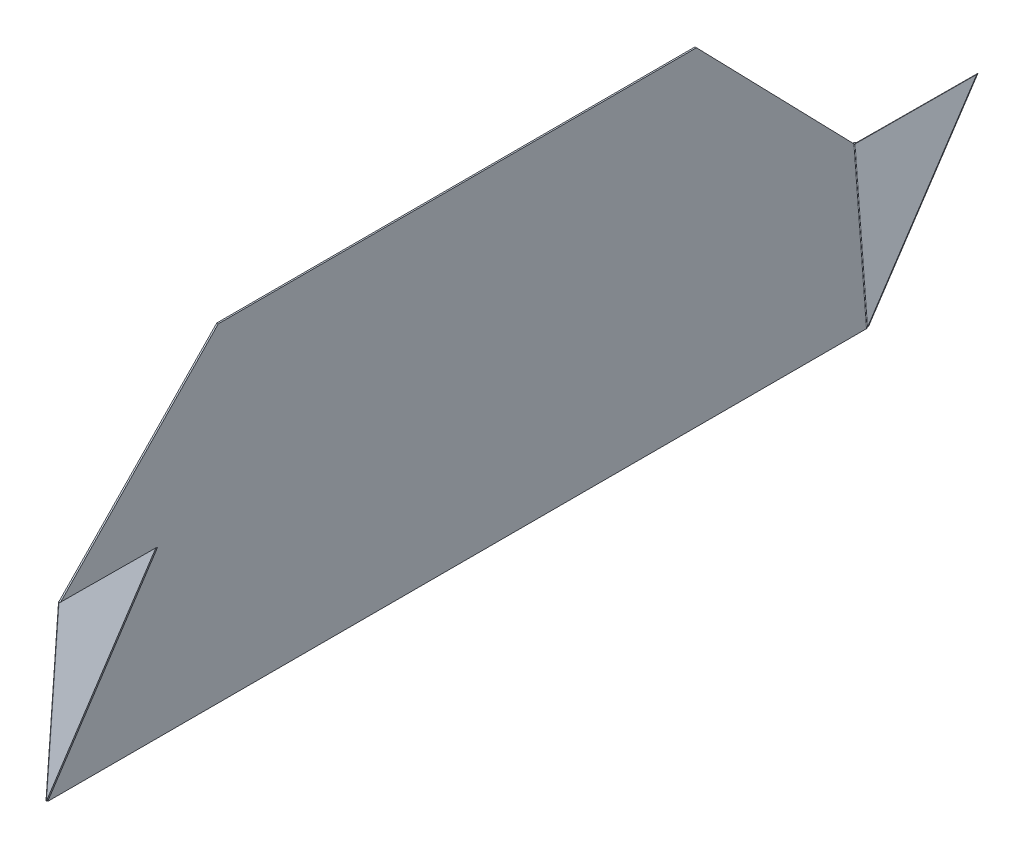
ISO-10303-21;
HEADER;
FILE_DESCRIPTION(('STEP AP214'),'2;1');
FILE_NAME('part.step','',(''),(''),'','','');
FILE_SCHEMA(('AUTOMOTIVE_DESIGN { 1 0 10303 214 1 1 1 1 }'));
ENDSEC;
DATA;
#1=APPLICATION_CONTEXT('core data for automotive mechanical design processes');
#2=APPLICATION_PROTOCOL_DEFINITION('international standard','automotive_design',2000,#1);
#3=PRODUCT_CONTEXT('',#1,'mechanical');
#4=PRODUCT('Part','Part','',(#3));
#5=PRODUCT_RELATED_PRODUCT_CATEGORY('part','',(#4));
#6=PRODUCT_DEFINITION_FORMATION('','',#4);
#7=PRODUCT_DEFINITION_CONTEXT('part definition',#1,'design');
#8=PRODUCT_DEFINITION('design','',#6,#7);
#9=PRODUCT_DEFINITION_SHAPE('','',#8);
#10=(LENGTH_UNIT() NAMED_UNIT(*) SI_UNIT(.MILLI.,.METRE.));
#11=(NAMED_UNIT(*) PLANE_ANGLE_UNIT() SI_UNIT($,.RADIAN.));
#12=(NAMED_UNIT(*) SI_UNIT($,.STERADIAN.) SOLID_ANGLE_UNIT());
#13=UNCERTAINTY_MEASURE_WITH_UNIT(LENGTH_MEASURE(1.E-05),#10,'distance_accuracy_value','');
#14=(GEOMETRIC_REPRESENTATION_CONTEXT(3) GLOBAL_UNCERTAINTY_ASSIGNED_CONTEXT((#13)) GLOBAL_UNIT_ASSIGNED_CONTEXT((#10,
#11,#12)) REPRESENTATION_CONTEXT('',''));
#15=CARTESIAN_POINT('',(0.,0.,0.));
#16=DIRECTION('',(0.,0.,1.));
#17=DIRECTION('',(1.,0.,0.));
#18=AXIS2_PLACEMENT_3D('',#15,#16,#17);
#19=CARTESIAN_POINT('',(10.,0.,0.));
#20=DIRECTION('',(0.,1.,0.));
#21=DIRECTION('',(0.,0.,1.));
#22=AXIS2_PLACEMENT_3D('',#19,#20,#21);
#23=PLANE('',#22);
#24=DIRECTION('',(1.,0.,0.));
#25=VECTOR('',#24,1.);
#26=CARTESIAN_POINT('',(10.,0.,419.37639410595));
#27=LINE('',#26,#25);
#28=CARTESIAN_POINT('',(8.49999999999995,0.,419.37639410595));
#29=VERTEX_POINT('',#28);
#30=CARTESIAN_POINT('',(10.,0.,419.37639410595));
#31=VERTEX_POINT('',#30);
#32=EDGE_CURVE('E11',#29,#31,#27,.T.);
#33=ORIENTED_EDGE('',*,*,#32,.F.);
#34=DIRECTION('',(0.,0.,-1.));
#35=VECTOR('',#34,1.);
#36=CARTESIAN_POINT('',(8.49999999999995,0.,0.));
#37=LINE('',#36,#35);
#38=CARTESIAN_POINT('',(8.49999999999995,0.,-419.37639410595));
#39=VERTEX_POINT('',#38);
#40=EDGE_CURVE('E86',#39,#29,#37,.F.);
#41=ORIENTED_EDGE('',*,*,#40,.F.);
#42=DIRECTION('',(1.,0.,0.));
#43=VECTOR('',#42,1.);
#44=CARTESIAN_POINT('',(10.,0.,-419.37639410595));
#45=LINE('',#44,#43);
#46=CARTESIAN_POINT('',(10.,0.,-419.37639410595));
#47=VERTEX_POINT('',#46);
#48=EDGE_CURVE('E119',#39,#47,#45,.T.);
#49=ORIENTED_EDGE('',*,*,#48,.T.);
#50=DIRECTION('',(0.,0.,1.));
#51=VECTOR('',#50,1.);
#52=CARTESIAN_POINT('',(10.,0.,0.));
#53=LINE('',#52,#51);
#54=EDGE_CURVE('E89',#47,#31,#53,.T.);
#55=ORIENTED_EDGE('',*,*,#54,.T.);
#56=EDGE_LOOP('',(#33,#41,#49,#55));
#57=FACE_BOUND('',#56,.T.);
#58=ADVANCED_FACE('F39',(#57),#23,.F.);
#59=CARTESIAN_POINT('',(10.,336.667890503002,0.));
#60=DIRECTION('',(0.,1.,0.));
#61=DIRECTION('',(0.,0.,1.));
#62=AXIS2_PLACEMENT_3D('',#59,#60,#61);
#63=PLANE('',#62);
#64=DIRECTION('',(0.,0.,1.));
#65=VECTOR('',#64,1.);
#66=CARTESIAN_POINT('',(10.,336.667890503002,0.));
#67=LINE('',#66,#65);
#68=CARTESIAN_POINT('',(10.,336.667890503002,-245.16369055211));
#69=VERTEX_POINT('',#68);
#70=CARTESIAN_POINT('',(10.,336.667890503002,245.16369055211));
#71=VERTEX_POINT('',#70);
#72=EDGE_CURVE('E144',#69,#71,#67,.T.);
#73=ORIENTED_EDGE('',*,*,#72,.F.);
#74=DIRECTION('',(1.,0.,0.));
#75=VECTOR('',#74,1.);
#76=CARTESIAN_POINT('',(10.,336.667890503002,-245.16369055211));
#77=LINE('',#76,#75);
#78=CARTESIAN_POINT('',(8.49999999999995,336.667890503002,-245.16369055211));
#79=VERTEX_POINT('',#78);
#80=EDGE_CURVE('E123',#79,#69,#77,.T.);
#81=ORIENTED_EDGE('',*,*,#80,.F.);
#82=DIRECTION('',(0.,0.,-1.));
#83=VECTOR('',#82,1.);
#84=CARTESIAN_POINT('',(8.49999999999995,336.667890503002,0.));
#85=LINE('',#84,#83);
#86=CARTESIAN_POINT('',(8.49999999999995,336.667890503002,245.16369055211));
#87=VERTEX_POINT('',#86);
#88=EDGE_CURVE('E121',#79,#87,#85,.F.);
#89=ORIENTED_EDGE('',*,*,#88,.T.);
#90=DIRECTION('',(1.,0.,0.));
#91=VECTOR('',#90,1.);
#92=CARTESIAN_POINT('',(10.,336.667890503002,245.16369055211));
#93=LINE('',#92,#91);
#94=EDGE_CURVE('E51',#87,#71,#93,.T.);
#95=ORIENTED_EDGE('',*,*,#94,.T.);
#96=EDGE_LOOP('',(#73,#81,#89,#95));
#97=FACE_BOUND('',#96,.T.);
#98=ADVANCED_FACE('F141',(#97),#63,.T.);
#99=CARTESIAN_POINT('',(10.,170.,407.16369055211));
#100=DIRECTION('',(0.,0.696993838192432,0.717077115463729));
#101=DIRECTION('',(0.,-0.717077115463729,0.696993838192432));
#102=AXIS2_PLACEMENT_3D('',#99,#100,#101);
#103=PLANE('',#102);
#104=ORIENTED_EDGE('',*,*,#94,.F.);
#105=DIRECTION('',(0.,-0.717077115463729,0.696993838192432));
#106=VECTOR('',#105,1.);
#107=CARTESIAN_POINT('',(8.49999999999995,170.,407.16369055211));
#108=LINE('',#107,#106);
#109=CARTESIAN_POINT('',(8.49999999999995,170.695612065733,406.487560589052));
#110=VERTEX_POINT('',#109);
#111=EDGE_CURVE('E116',#87,#110,#108,.T.);
#112=ORIENTED_EDGE('',*,*,#111,.T.);
#113=DIRECTION('',(1.,0.,0.));
#114=VECTOR('',#113,1.);
#115=CARTESIAN_POINT('',(10.,170.695612065733,406.487560589052));
#116=LINE('',#115,#114);
#117=CARTESIAN_POINT('',(10.,170.695612065733,406.487560589052));
#118=VERTEX_POINT('',#117);
#119=EDGE_CURVE('E132',#110,#118,#116,.T.);
#120=ORIENTED_EDGE('',*,*,#119,.T.);
#121=DIRECTION('',(0.,-0.717077115463729,0.696993838192432));
#122=VECTOR('',#121,1.);
#123=CARTESIAN_POINT('',(10.,170.,407.16369055211));
#124=LINE('',#123,#122);
#125=EDGE_CURVE('E155',#71,#118,#124,.T.);
#126=ORIENTED_EDGE('',*,*,#125,.F.);
#127=EDGE_LOOP('',(#104,#112,#120,#126));
#128=FACE_BOUND('',#127,.T.);
#129=ADVANCED_FACE('F163',(#128),#103,.T.);
#130=CARTESIAN_POINT('',(10.2173044583433,170.366797823547,407.041845531977));
#131=CARTESIAN_POINT('',(9.86217409723888,170.393298781834,407.392815795434));
#132=CARTESIAN_POINT('',(9.50704373613442,170.419799740121,407.743786058892));
#133=CARTESIAN_POINT('',(9.15191337502996,170.446300698408,408.09475632235));
#134=CARTESIAN_POINT('',(11.273212522332,170.447014706875,408.104212423419));
#135=CARTESIAN_POINT('',(11.6220208705534,170.526993587381,409.163427281172));
#136=CARTESIAN_POINT('',(11.9708292187745,170.606972467886,410.222642138925));
#137=CARTESIAN_POINT('',(12.3196375669958,170.686951348391,411.281856996677));
#138=CARTESIAN_POINT('',(12.3386036056454,172.911631375804,406.859201011066));
#139=CARTESIAN_POINT('',(13.3976726760756,172.938608339735,407.216475341903));
#140=CARTESIAN_POINT('',(14.4567417465058,172.965585303667,407.57374967274));
#141=CARTESIAN_POINT('',(15.515810816936,172.992562267599,407.931024003577));
#142=CARTESIAN_POINT('',(11.2826955416567,172.831414492476,405.796834119624));
#143=CARTESIAN_POINT('',(11.6378259027612,172.804913534189,405.445863856166));
#144=CARTESIAN_POINT('',(11.9929562638657,172.778412575902,405.094893592708));
#145=CARTESIAN_POINT('',(12.3480866249701,172.751911617615,404.74392332925));
#146=CARTESIAN_POINT('',(10.2267874776679,172.751197609148,404.734467228181));
#147=CARTESIAN_POINT('',(9.87797912944655,172.671218728642,403.675252370428));
#148=CARTESIAN_POINT('',(9.5291707812255,172.591239848137,402.616037512676));
#149=CARTESIAN_POINT('',(9.18036243300413,172.511260967632,401.556822654923));
#150=CARTESIAN_POINT('',(9.16139639435454,170.286580940219,405.979478640534));
#151=CARTESIAN_POINT('',(8.10232732392435,170.259603976288,405.622204309697));
#152=CARTESIAN_POINT('',(7.04325825349417,170.232627012356,405.26492997886));
#153=CARTESIAN_POINT('',(5.98418918306398,170.205650048424,404.907655648023));
#154=CARTESIAN_POINT('',(10.2173044583433,170.366797823547,407.041845531977));
#155=CARTESIAN_POINT('',(9.86217409723888,170.393298781834,407.392815795434));
#156=CARTESIAN_POINT('',(9.50704373613442,170.419799740121,407.743786058892));
#157=CARTESIAN_POINT('',(9.15191337502996,170.446300698408,408.09475632235));
#158=(BOUNDED_SURFACE() B_SPLINE_SURFACE(3,3,((#130,#131,#132,#133),(#134,#135,#136,#137),(#138,
#139,#140,#141),(#142,#143,#144,#145),(#146,#147,#148,#149),(#150,#151,#152,#153),(#154,#155,
#156,#157)),.UNSPECIFIED.,.T.,.F.,.F.) B_SPLINE_SURFACE_WITH_KNOTS((4,3,4),(4,4),(0.,0.5,1.),
(0.,1.),.UNSPECIFIED.) GEOMETRIC_REPRESENTATION_ITEM() RATIONAL_B_SPLINE_SURFACE(((1.,1.,1.,1.),
(0.333333333333333,0.333333333333333,0.333333333333333,0.333333333333333),(0.333333333333333,
0.333333333333333,0.333333333333333,0.333333333333333),(1.,1.,1.,1.),(0.333333333333333,
0.333333333333333,0.333333333333333,0.333333333333333),(0.333333333333333,0.333333333333333,
0.333333333333333,0.333333333333333),(1.,1.,1.,1.))) REPRESENTATION_ITEM('') SURFACE());
#159=CARTESIAN_POINT('',(10.75,171.599106158011,406.4193398258));
#160=DIRECTION('',(-0.350308985086468,0.893581116930475,0.28070696897828));
#161=DIRECTION('',(-0.617862370176753,-0.445704946461743,0.647760134786867));
#162=AXIS2_PLACEMENT_3D('',#159,#160,#161);
#163=ELLIPSE('',#162,2.58647670113481,2.25);
#164=CARTESIAN_POINT('',(10.333223597649,170.718270894438,408.703206316444));
#165=VERTEX_POINT('',#164);
#166=EDGE_CURVE('E103',#110,#165,#163,.T.);
#167=DIRECTION('',(0.185233956600411,-0.07399037522197,-0.979904998301707));
#168=VECTOR('',#167,1.);
#169=CARTESIAN_POINT('',(10.6110745325496,170.607285331605,407.233348818991));
#170=LINE('',#169,#168);
#171=CARTESIAN_POINT('',(10.6110745325496,170.607285331605,407.233348818991));
#172=VERTEX_POINT('',#171);
#173=EDGE_CURVE('E130',#165,#172,#170,.T.);
#174=CARTESIAN_POINT('',(10.75,171.599106158011,406.4193398258));
#175=DIRECTION('',(-0.612282012254421,0.551070823812249,0.566949455077405));
#176=DIRECTION('',(-0.359973653178135,-0.832743093023334,0.420663654288695));
#177=AXIS2_PLACEMENT_3D('',#174,#175,#176);
#178=ELLIPSE('',#177,1.47981813933777,0.75);
#179=EDGE_CURVE('E161',#118,#172,#178,.T.);
#180=ORIENTED_EDGE('',*,*,#119,.F.);
#181=ORIENTED_EDGE('',*,*,#166,.T.);
#182=ORIENTED_EDGE('',*,*,#173,.T.);
#183=ORIENTED_EDGE('',*,*,#179,.F.);
#184=EDGE_LOOP('',(#180,#181,#182,#183));
#185=FACE_BOUND('',#184,.T.);
#186=ADVANCED_FACE('F294',(#185),#158,.F.);
#187=CARTESIAN_POINT('',(66.3030214988494,225.953893117886,413.581845276055));
#188=DIRECTION('',(-0.682529199996483,0.707716651063141,-0.182458304716812));
#189=DIRECTION('',(-0.706995242186479,-0.702611248260718,-0.0805925638207273));
#190=AXIS2_PLACEMENT_3D('',#187,#188,#189);
#191=PLANE('',#190);
#192=ORIENTED_EDGE('',*,*,#173,.F.);
#193=DIRECTION('',(-0.706995242186479,-0.702611248260718,-0.0805925638207273));
#194=VECTOR('',#193,1.);
#195=CARTESIAN_POINT('',(66.025170563949,226.064878680719,415.051702773508));
#196=LINE('',#195,#194);
#197=CARTESIAN_POINT('',(122.328192062798,282.018771798606,421.469857497453));
#198=VERTEX_POINT('',#197);
#199=EDGE_CURVE('E115',#198,#165,#196,.T.);
#200=ORIENTED_EDGE('',*,*,#199,.F.);
#201=DIRECTION('',(0.185233956600411,-0.07399037522197,-0.979904998301707));
#202=VECTOR('',#201,1.);
#203=CARTESIAN_POINT('',(122.606042997699,281.907786235773,420.));
#204=LINE('',#203,#202);
#205=CARTESIAN_POINT('',(122.606042997699,281.907786235773,420.));
#206=VERTEX_POINT('',#205);
#207=EDGE_CURVE('E127',#198,#206,#204,.T.);
#208=ORIENTED_EDGE('',*,*,#207,.T.);
#209=DIRECTION('',(-0.706995242186479,-0.702611248260718,-0.0805925638207273));
#210=VECTOR('',#209,1.);
#211=CARTESIAN_POINT('',(66.3030214988494,225.953893117886,413.581845276055));
#212=LINE('',#211,#210);
#213=EDGE_CURVE('E165',#206,#172,#212,.T.);
#214=ORIENTED_EDGE('',*,*,#213,.T.);
#215=EDGE_LOOP('',(#192,#200,#208,#214));
#216=FACE_BOUND('',#215,.T.);
#217=ADVANCED_FACE('F282',(#216),#191,.T.);
#218=CARTESIAN_POINT('',(66.3030214988494,140.953893117886,420.));
#219=DIRECTION('',(0.909993681143599,-0.363490448258812,0.19946476957932));
#220=DIRECTION('',(0.370944580228475,0.928655005047149,0.));
#221=AXIS2_PLACEMENT_3D('',#218,#219,#220);
#222=PLANE('',#221);
#223=ORIENTED_EDGE('',*,*,#207,.F.);
#224=DIRECTION('',(0.370944580228475,0.928655005047149,0.));
#225=VECTOR('',#224,1.);
#226=CARTESIAN_POINT('',(66.0251705639487,141.064878680719,421.469857497453));
#227=LINE('',#226,#225);
#228=CARTESIAN_POINT('',(10.333223597649,1.64080282761021,421.469857497453));
#229=VERTEX_POINT('',#228);
#230=EDGE_CURVE('E108',#229,#198,#227,.T.);
#231=ORIENTED_EDGE('',*,*,#230,.F.);
#232=DIRECTION('',(0.185233956600395,-0.0739903752219733,-0.97990499830171));
#233=VECTOR('',#232,1.);
#234=CARTESIAN_POINT('',(10.6110745325496,1.52981726477719,420.));
#235=LINE('',#234,#233);
#236=CARTESIAN_POINT('',(10.6110745325496,1.52981726477719,420.));
#237=VERTEX_POINT('',#236);
#238=EDGE_CURVE('E45',#229,#237,#235,.T.);
#239=ORIENTED_EDGE('',*,*,#238,.T.);
#240=DIRECTION('',(0.370944580228475,0.928655005047149,0.));
#241=VECTOR('',#240,1.);
#242=CARTESIAN_POINT('',(66.3030214988494,140.953893117886,420.));
#243=LINE('',#242,#241);
#244=EDGE_CURVE('E171',#237,#206,#243,.T.);
#245=ORIENTED_EDGE('',*,*,#244,.T.);
#246=EDGE_LOOP('',(#223,#231,#239,#245));
#247=FACE_BOUND('',#246,.T.);
#248=ADVANCED_FACE('F287',(#247),#222,.T.);
#249=CARTESIAN_POINT('',(8.50101690580463,0.00424378517362156,419.443905269473));
#250=CARTESIAN_POINT('',(9.00079092673711,0.00311205796636738,419.428917034263));
#251=CARTESIAN_POINT('',(9.50056494766938,0.00198033075912707,419.413928799053));
#252=CARTESIAN_POINT('',(10.0003389686016,0.000848603551872884,419.398940563843));
#253=CARTESIAN_POINT('',(8.36573879192248,-0.334423240107767,414.958706892824));
#254=CARTESIAN_POINT('',(8.89557461593948,-0.260295628363598,415.940429407981));
#255=CARTESIAN_POINT('',(9.42541043995682,-0.186168016619429,416.922151923137));
#256=CARTESIAN_POINT('',(9.95524626397415,-0.112040404875259,417.903874438293));
#257=CARTESIAN_POINT('',(12.8637049803129,3.4123199755362,414.540135716267));
#258=CARTESIAN_POINT('',(12.3939927624656,3.48871104169488,415.551834701843));
#259=CARTESIAN_POINT('',(11.9242805446182,3.56510210785355,416.563533687419));
#260=CARTESIAN_POINT('',(11.4545683267709,3.64149317401223,417.575232672995));
#261=CARTESIAN_POINT('',(12.9989830941952,3.75098700081759,419.025334092915));
#262=CARTESIAN_POINT('',(12.499209073263,3.75211872802485,419.040322328125));
#263=CARTESIAN_POINT('',(11.9994350523307,3.7532504552321,419.055310563335));
#264=CARTESIAN_POINT('',(11.4996610313984,3.75438218243936,419.070298798545));
#265=CARTESIAN_POINT('',(13.1342612080778,4.089654026099,423.510532469564));
#266=CARTESIAN_POINT('',(12.6044253840605,4.01552641435483,422.528809954408));
#267=CARTESIAN_POINT('',(12.0745895600431,3.94139880261066,421.547087439251));
#268=CARTESIAN_POINT('',(11.5447537360258,3.86727119086649,420.565364924095));
#269=CARTESIAN_POINT('',(8.6362950196871,0.342910810455024,423.929103646121));
#270=CARTESIAN_POINT('',(9.10600723753441,0.266519744296343,422.917404660545));
#271=CARTESIAN_POINT('',(9.57571945538172,0.190128678137672,421.905705674969));
#272=CARTESIAN_POINT('',(10.045431673229,0.113737611979001,420.894006689392));
#273=CARTESIAN_POINT('',(8.50101690580463,0.00424378517362156,419.443905269473));
#274=CARTESIAN_POINT('',(9.00079092673711,0.00311205796636738,419.428917034263));
#275=CARTESIAN_POINT('',(9.50056494766938,0.00198033075912707,419.413928799053));
#276=CARTESIAN_POINT('',(10.0003389686016,0.000848603551872884,419.398940563843));
#277=(BOUNDED_SURFACE() B_SPLINE_SURFACE(3,3,((#249,#250,#251,#252),(#253,#254,#255,#256),(#257,
#258,#259,#260),(#261,#262,#263,#264),(#265,#266,#267,#268),(#269,#270,#271,#272),(#273,#274,
#275,#276)),.UNSPECIFIED.,.T.,.F.,.F.) B_SPLINE_SURFACE_WITH_KNOTS((4,3,4),(4,4),(0.,0.5,1.),
(0.,1.),.UNSPECIFIED.) GEOMETRIC_REPRESENTATION_ITEM() RATIONAL_B_SPLINE_SURFACE(((1.,1.,1.,1.),
(0.333333333333333,0.333333333333333,0.333333333333333,0.333333333333333),(0.333333333333333,
0.333333333333333,0.333333333333333,0.333333333333333),(1.,1.,1.,1.),(0.333333333333333,
0.333333333333333,0.333333333333333,0.333333333333333),(0.333333333333333,0.333333333333333,
0.333333333333333,0.333333333333333),(1.,1.,1.,1.))) REPRESENTATION_ITEM('') SURFACE());
#278=CARTESIAN_POINT('',(10.75,1.87761539299561,419.234619681194));
#279=DIRECTION('',(-0.641664709039219,0.766019024423177,-0.0384870808892977));
#280=DIRECTION('',(-0.766395908893631,-0.638397122583083,0.0713191749023056));
#281=AXIS2_PLACEMENT_3D('',#278,#279,#280);
#282=ELLIPSE('',#281,2.93449256199957,2.25);
#283=EDGE_CURVE('E101',#229,#29,#282,.F.);
#284=CARTESIAN_POINT('',(10.75,1.87761539299561,419.234619681194));
#285=DIRECTION('',(-0.928655005047149,0.370944580228475,0.));
#286=DIRECTION('',(-0.369724450903859,-0.925600426912021,0.081041224720044));
#287=AXIS2_PLACEMENT_3D('',#284,#285,#286);
#288=ELLIPSE('',#287,2.02762092029818,0.75);
#289=EDGE_CURVE('E178',#237,#31,#288,.F.);
#290=ORIENTED_EDGE('',*,*,#283,.T.);
#291=ORIENTED_EDGE('',*,*,#32,.T.);
#292=ORIENTED_EDGE('',*,*,#289,.F.);
#293=ORIENTED_EDGE('',*,*,#238,.F.);
#294=EDGE_LOOP('',(#290,#291,#292,#293));
#295=FACE_BOUND('',#294,.T.);
#296=ADVANCED_FACE('F41',(#295),#277,.T.);
#297=CARTESIAN_POINT('',(10.,170.,407.16369055211));
#298=DIRECTION('',(-0.185233956600411,0.07399037522197,0.979904998301707));
#299=DIRECTION('',(0.,-0.997161425585,0.0752933684018133));
#300=AXIS2_PLACEMENT_3D('',#297,#298,#299);
#301=PLANE('',#300);
#302=ORIENTED_EDGE('',*,*,#244,.F.);
#303=DIRECTION('',(0.,-0.997161425585,0.0752933684018133));
#304=VECTOR('',#303,1.);
#305=CARTESIAN_POINT('',(10.6110745325496,170.008672673785,407.278548685551));
#306=LINE('',#305,#304);
#307=EDGE_CURVE('E175',#237,#172,#306,.F.);
#308=ORIENTED_EDGE('',*,*,#307,.T.);
#309=ORIENTED_EDGE('',*,*,#213,.F.);
#310=EDGE_LOOP('',(#302,#308,#309));
#311=FACE_BOUND('',#310,.T.);
#312=ADVANCED_FACE('F285',(#311),#301,.F.);
#313=CARTESIAN_POINT('',(10.,0.,0.));
#314=DIRECTION('',(1.,0.,0.));
#315=DIRECTION('',(0.,0.,-1.));
#316=AXIS2_PLACEMENT_3D('',#313,#314,#315);
#317=PLANE('',#316);
#318=ORIENTED_EDGE('',*,*,#125,.T.);
#319=DIRECTION('',(0.,-0.997161425585,0.0752933684018133));
#320=VECTOR('',#319,1.);
#321=CARTESIAN_POINT('',(10.,31.486629772881,416.998911028092));
#322=LINE('',#321,#320);
#323=EDGE_CURVE('E173',#118,#31,#322,.T.);
#324=ORIENTED_EDGE('',*,*,#323,.T.);
#325=ORIENTED_EDGE('',*,*,#54,.F.);
#326=DIRECTION('',(0.,-0.997161425585,-0.0752933684018133));
#327=VECTOR('',#326,1.);
#328=CARTESIAN_POINT('',(10.,31.486629772881,-416.998911028092));
#329=LINE('',#328,#327);
#330=CARTESIAN_POINT('',(10.,170.695612065733,-406.487560589052));
#331=VERTEX_POINT('',#330);
#332=EDGE_CURVE('E217',#331,#47,#329,.T.);
#333=ORIENTED_EDGE('',*,*,#332,.F.);
#334=DIRECTION('',(0.,-0.717077115463729,-0.696993838192432));
#335=VECTOR('',#334,1.);
#336=CARTESIAN_POINT('',(10.,170.,-407.16369055211));
#337=LINE('',#336,#335);
#338=EDGE_CURVE('E159',#69,#331,#337,.T.);
#339=ORIENTED_EDGE('',*,*,#338,.F.);
#340=ORIENTED_EDGE('',*,*,#72,.T.);
#341=EDGE_LOOP('',(#318,#324,#325,#333,#339,#340));
#342=FACE_BOUND('',#341,.T.);
#343=ADVANCED_FACE('F153',(#342),#317,.T.);
#344=CARTESIAN_POINT('',(10.75,31.486629772881,416.998911028092));
#345=DIRECTION('',(0.,-0.997161425585,0.0752933684018133));
#346=DIRECTION('',(0.,-0.0752933684018133,-0.997161425585));
#347=AXIS2_PLACEMENT_3D('',#344,#345,#346);
#348=CYLINDRICAL_SURFACE('',#347,0.75);
#349=ORIENTED_EDGE('',*,*,#179,.T.);
#350=ORIENTED_EDGE('',*,*,#307,.F.);
#351=ORIENTED_EDGE('',*,*,#289,.T.);
#352=ORIENTED_EDGE('',*,*,#323,.F.);
#353=EDGE_LOOP('',(#349,#350,#351,#352));
#354=FACE_BOUND('',#353,.T.);
#355=ADVANCED_FACE('F318',(#354),#348,.F.);
#356=CARTESIAN_POINT('',(9.72214906509938,170.110985562832,408.633548049563));
#357=DIRECTION('',(-0.185233956600411,0.07399037522197,0.979904998301707));
#358=DIRECTION('',(0.,-0.997161425585,0.0752933684018133));
#359=AXIS2_PLACEMENT_3D('',#356,#357,#358);
#360=PLANE('',#359);
#361=ORIENTED_EDGE('',*,*,#230,.T.);
#362=ORIENTED_EDGE('',*,*,#199,.T.);
#363=DIRECTION('',(0.,-0.997161425585,0.0752933684018133));
#364=VECTOR('',#363,1.);
#365=CARTESIAN_POINT('',(10.333223597649,170.119658236618,408.748406183004));
#366=LINE('',#365,#364);
#367=EDGE_CURVE('E107',#229,#165,#366,.F.);
#368=ORIENTED_EDGE('',*,*,#367,.F.);
#369=EDGE_LOOP('',(#361,#362,#368));
#370=FACE_BOUND('',#369,.T.);
#371=ADVANCED_FACE('F320',(#370),#360,.T.);
#372=CARTESIAN_POINT('',(8.49999999999995,0.,0.));
#373=DIRECTION('',(1.,0.,0.));
#374=DIRECTION('',(0.,0.,-1.));
#375=AXIS2_PLACEMENT_3D('',#372,#373,#374);
#376=PLANE('',#375);
#377=ORIENTED_EDGE('',*,*,#111,.F.);
#378=ORIENTED_EDGE('',*,*,#88,.F.);
#379=DIRECTION('',(0.,-0.717077115463729,-0.696993838192432));
#380=VECTOR('',#379,1.);
#381=CARTESIAN_POINT('',(8.49999999999995,170.,-407.16369055211));
#382=LINE('',#381,#380);
#383=CARTESIAN_POINT('',(8.49999999999995,170.695612065733,-406.487560589052));
#384=VERTEX_POINT('',#383);
#385=EDGE_CURVE('E190',#79,#384,#382,.T.);
#386=ORIENTED_EDGE('',*,*,#385,.T.);
#387=DIRECTION('',(0.,-0.997161425585,-0.0752933684018133));
#388=VECTOR('',#387,1.);
#389=CARTESIAN_POINT('',(8.49999999999995,31.486629772881,-416.998911028092));
#390=LINE('',#389,#388);
#391=EDGE_CURVE('E113',#384,#39,#390,.T.);
#392=ORIENTED_EDGE('',*,*,#391,.T.);
#393=ORIENTED_EDGE('',*,*,#40,.T.);
#394=DIRECTION('',(0.,-0.997161425585,0.0752933684018133));
#395=VECTOR('',#394,1.);
#396=CARTESIAN_POINT('',(8.49999999999995,31.486629772881,416.998911028092));
#397=LINE('',#396,#395);
#398=EDGE_CURVE('E98',#110,#29,#397,.T.);
#399=ORIENTED_EDGE('',*,*,#398,.F.);
#400=EDGE_LOOP('',(#377,#378,#386,#392,#393,#399));
#401=FACE_BOUND('',#400,.T.);
#402=ADVANCED_FACE('F110',(#401),#376,.F.);
#403=CARTESIAN_POINT('',(10.75,31.486629772881,416.998911028092));
#404=DIRECTION('',(0.,-0.997161425585,0.0752933684018133));
#405=DIRECTION('',(0.,-0.0752933684018133,-0.997161425585));
#406=AXIS2_PLACEMENT_3D('',#403,#404,#405);
#407=CYLINDRICAL_SURFACE('',#406,2.25);
#408=ORIENTED_EDGE('',*,*,#166,.F.);
#409=ORIENTED_EDGE('',*,*,#398,.T.);
#410=ORIENTED_EDGE('',*,*,#283,.F.);
#411=ORIENTED_EDGE('',*,*,#367,.T.);
#412=EDGE_LOOP('',(#408,#409,#410,#411));
#413=FACE_BOUND('',#412,.T.);
#414=ADVANCED_FACE('F99',(#413),#407,.T.);
#415=CARTESIAN_POINT('',(10.,170.,-407.16369055211));
#416=DIRECTION('',(0.,0.696993838192432,-0.717077115463729));
#417=DIRECTION('',(0.,-0.717077115463729,-0.696993838192432));
#418=AXIS2_PLACEMENT_3D('',#415,#416,#417);
#419=PLANE('',#418);
#420=ORIENTED_EDGE('',*,*,#80,.T.);
#421=ORIENTED_EDGE('',*,*,#338,.T.);
#422=DIRECTION('',(1.,0.,0.));
#423=VECTOR('',#422,1.);
#424=CARTESIAN_POINT('',(10.,170.695612065733,-406.487560589052));
#425=LINE('',#424,#423);
#426=EDGE_CURVE('E197',#384,#331,#425,.T.);
#427=ORIENTED_EDGE('',*,*,#426,.F.);
#428=ORIENTED_EDGE('',*,*,#385,.F.);
#429=EDGE_LOOP('',(#420,#421,#427,#428));
#430=FACE_BOUND('',#429,.T.);
#431=ADVANCED_FACE('F195',(#430),#419,.T.);
#432=CARTESIAN_POINT('',(10.2173044583433,170.366797823547,-407.041845531977));
#433=CARTESIAN_POINT('',(9.86217409723888,170.393298781834,-407.392815795434));
#434=CARTESIAN_POINT('',(9.50704373613442,170.419799740121,-407.743786058892));
#435=CARTESIAN_POINT('',(9.15191337502996,170.446300698408,-408.09475632235));
#436=CARTESIAN_POINT('',(11.273212522332,170.447014706875,-408.104212423419));
#437=CARTESIAN_POINT('',(11.6220208705534,170.526993587381,-409.163427281172));
#438=CARTESIAN_POINT('',(11.9708292187745,170.606972467886,-410.222642138925));
#439=CARTESIAN_POINT('',(12.3196375669958,170.686951348391,-411.281856996677));
#440=CARTESIAN_POINT('',(12.3386036056454,172.911631375804,-406.859201011066));
#441=CARTESIAN_POINT('',(13.3976726760756,172.938608339735,-407.216475341903));
#442=CARTESIAN_POINT('',(14.4567417465058,172.965585303667,-407.57374967274));
#443=CARTESIAN_POINT('',(15.515810816936,172.992562267599,-407.931024003577));
#444=CARTESIAN_POINT('',(11.2826955416567,172.831414492476,-405.796834119624));
#445=CARTESIAN_POINT('',(11.6378259027612,172.804913534189,-405.445863856166));
#446=CARTESIAN_POINT('',(11.9929562638657,172.778412575902,-405.094893592708));
#447=CARTESIAN_POINT('',(12.3480866249701,172.751911617615,-404.74392332925));
#448=CARTESIAN_POINT('',(10.2267874776679,172.751197609148,-404.734467228181));
#449=CARTESIAN_POINT('',(9.87797912944655,172.671218728642,-403.675252370428));
#450=CARTESIAN_POINT('',(9.5291707812255,172.591239848137,-402.616037512676));
#451=CARTESIAN_POINT('',(9.18036243300413,172.511260967632,-401.556822654923));
#452=CARTESIAN_POINT('',(9.16139639435454,170.286580940219,-405.979478640534));
#453=CARTESIAN_POINT('',(8.10232732392435,170.259603976288,-405.622204309697));
#454=CARTESIAN_POINT('',(7.04325825349417,170.232627012356,-405.26492997886));
#455=CARTESIAN_POINT('',(5.98418918306398,170.205650048424,-404.907655648023));
#456=CARTESIAN_POINT('',(10.2173044583433,170.366797823547,-407.041845531977));
#457=CARTESIAN_POINT('',(9.86217409723888,170.393298781834,-407.392815795434));
#458=CARTESIAN_POINT('',(9.50704373613442,170.419799740121,-407.743786058892));
#459=CARTESIAN_POINT('',(9.15191337502996,170.446300698408,-408.09475632235));
#460=(BOUNDED_SURFACE() B_SPLINE_SURFACE(3,3,((#432,#433,#434,#435),(#436,#437,#438,#439),(#440,
#441,#442,#443),(#444,#445,#446,#447),(#448,#449,#450,#451),(#452,#453,#454,#455),(#456,#457,
#458,#459)),.UNSPECIFIED.,.T.,.F.,.F.) B_SPLINE_SURFACE_WITH_KNOTS((4,3,4),(4,4),(0.,0.5,1.),
(0.,1.),.UNSPECIFIED.) GEOMETRIC_REPRESENTATION_ITEM() RATIONAL_B_SPLINE_SURFACE(((1.,1.,1.,1.),
(0.333333333333333,0.333333333333333,0.333333333333333,0.333333333333333),(0.333333333333333,
0.333333333333333,0.333333333333333,0.333333333333333),(1.,1.,1.,1.),(0.333333333333333,
0.333333333333333,0.333333333333333,0.333333333333333),(0.333333333333333,0.333333333333333,
0.333333333333333,0.333333333333333),(1.,1.,1.,1.))) REPRESENTATION_ITEM('') SURFACE());
#461=CARTESIAN_POINT('',(10.75,171.599106158011,-406.4193398258));
#462=DIRECTION('',(0.612282012254421,-0.551070823812249,0.566949455077405));
#463=DIRECTION('',(-0.359973653178135,-0.832743093023334,-0.420663654288695));
#464=AXIS2_PLACEMENT_3D('',#461,#462,#463);
#465=ELLIPSE('',#464,1.47981813933777,0.75);
#466=CARTESIAN_POINT('',(10.6110745325496,170.607285331605,-407.233348818991));
#467=VERTEX_POINT('',#466);
#468=EDGE_CURVE('E232',#331,#467,#465,.T.);
#469=DIRECTION('',(0.185233956600411,-0.07399037522197,0.979904998301707));
#470=VECTOR('',#469,1.);
#471=CARTESIAN_POINT('',(10.6110745325496,170.607285331605,-407.233348818991));
#472=LINE('',#471,#470);
#473=CARTESIAN_POINT('',(10.333223597649,170.718270894438,-408.703206316444));
#474=VERTEX_POINT('',#473);
#475=EDGE_CURVE('E202',#474,#467,#472,.T.);
#476=CARTESIAN_POINT('',(10.75,171.599106158011,-406.4193398258));
#477=DIRECTION('',(0.350308985086468,-0.893581116930475,0.28070696897828));
#478=DIRECTION('',(-0.617862370176753,-0.445704946461743,-0.647760134786867));
#479=AXIS2_PLACEMENT_3D('',#476,#477,#478);
#480=ELLIPSE('',#479,2.58647670113481,2.25);
#481=EDGE_CURVE('E199',#384,#474,#480,.T.);
#482=ORIENTED_EDGE('',*,*,#426,.T.);
#483=ORIENTED_EDGE('',*,*,#468,.T.);
#484=ORIENTED_EDGE('',*,*,#475,.F.);
#485=ORIENTED_EDGE('',*,*,#481,.F.);
#486=EDGE_LOOP('',(#482,#483,#484,#485));
#487=FACE_BOUND('',#486,.T.);
#488=ADVANCED_FACE('F261',(#487),#460,.T.);
#489=CARTESIAN_POINT('',(66.3030214988494,225.953893117886,-413.581845276055));
#490=DIRECTION('',(-0.682529199996483,0.707716651063141,0.182458304716812));
#491=DIRECTION('',(-0.706995242186479,-0.702611248260718,0.0805925638207273));
#492=AXIS2_PLACEMENT_3D('',#489,#490,#491);
#493=PLANE('',#492);
#494=ORIENTED_EDGE('',*,*,#475,.T.);
#495=DIRECTION('',(-0.706995242186479,-0.702611248260718,0.0805925638207273));
#496=VECTOR('',#495,1.);
#497=CARTESIAN_POINT('',(66.3030214988494,225.953893117886,-413.581845276055));
#498=LINE('',#497,#496);
#499=CARTESIAN_POINT('',(122.606042997699,281.907786235773,-420.));
#500=VERTEX_POINT('',#499);
#501=EDGE_CURVE('E254',#500,#467,#498,.T.);
#502=ORIENTED_EDGE('',*,*,#501,.F.);
#503=DIRECTION('',(0.185233956600411,-0.07399037522197,0.979904998301707));
#504=VECTOR('',#503,1.);
#505=CARTESIAN_POINT('',(122.606042997699,281.907786235773,-420.));
#506=LINE('',#505,#504);
#507=CARTESIAN_POINT('',(122.328192062798,282.018771798606,-421.469857497453));
#508=VERTEX_POINT('',#507);
#509=EDGE_CURVE('E207',#508,#500,#506,.T.);
#510=ORIENTED_EDGE('',*,*,#509,.F.);
#511=DIRECTION('',(-0.706995242186479,-0.702611248260718,0.0805925638207273));
#512=VECTOR('',#511,1.);
#513=CARTESIAN_POINT('',(66.025170563949,226.064878680719,-415.051702773508));
#514=LINE('',#513,#512);
#515=EDGE_CURVE('E198',#508,#474,#514,.T.);
#516=ORIENTED_EDGE('',*,*,#515,.T.);
#517=EDGE_LOOP('',(#494,#502,#510,#516));
#518=FACE_BOUND('',#517,.T.);
#519=ADVANCED_FACE('F251',(#518),#493,.T.);
#520=CARTESIAN_POINT('',(66.3030214988494,140.953893117886,-420.));
#521=DIRECTION('',(0.909993681143599,-0.363490448258812,-0.19946476957932));
#522=DIRECTION('',(0.370944580228475,0.928655005047149,0.));
#523=AXIS2_PLACEMENT_3D('',#520,#521,#522);
#524=PLANE('',#523);
#525=ORIENTED_EDGE('',*,*,#509,.T.);
#526=DIRECTION('',(0.370944580228475,0.928655005047149,0.));
#527=VECTOR('',#526,1.);
#528=CARTESIAN_POINT('',(66.3030214988494,140.953893117886,-420.));
#529=LINE('',#528,#527);
#530=CARTESIAN_POINT('',(10.6110745325496,1.52981726477719,-420.));
#531=VERTEX_POINT('',#530);
#532=EDGE_CURVE('E226',#531,#500,#529,.T.);
#533=ORIENTED_EDGE('',*,*,#532,.F.);
#534=DIRECTION('',(0.185233956600395,-0.0739903752219733,0.97990499830171));
#535=VECTOR('',#534,1.);
#536=CARTESIAN_POINT('',(10.6110745325496,1.52981726477719,-420.));
#537=LINE('',#536,#535);
#538=CARTESIAN_POINT('',(10.333223597649,1.64080282761021,-421.469857497453));
#539=VERTEX_POINT('',#538);
#540=EDGE_CURVE('E205',#539,#531,#537,.T.);
#541=ORIENTED_EDGE('',*,*,#540,.F.);
#542=DIRECTION('',(0.370944580228475,0.928655005047149,0.));
#543=VECTOR('',#542,1.);
#544=CARTESIAN_POINT('',(66.0251705639487,141.064878680719,-421.469857497453));
#545=LINE('',#544,#543);
#546=EDGE_CURVE('E239',#539,#508,#545,.T.);
#547=ORIENTED_EDGE('',*,*,#546,.T.);
#548=EDGE_LOOP('',(#525,#533,#541,#547));
#549=FACE_BOUND('',#548,.T.);
#550=ADVANCED_FACE('F350',(#549),#524,.T.);
#551=CARTESIAN_POINT('',(8.50101690580463,0.00424378517362156,-419.443905269473));
#552=CARTESIAN_POINT('',(9.00079092673711,0.00311205796636738,-419.428917034263));
#553=CARTESIAN_POINT('',(9.50056494766938,0.00198033075912707,-419.413928799053));
#554=CARTESIAN_POINT('',(10.0003389686016,0.000848603551872884,-419.398940563843));
#555=CARTESIAN_POINT('',(8.36573879192248,-0.334423240107767,-414.958706892824));
#556=CARTESIAN_POINT('',(8.89557461593948,-0.260295628363598,-415.940429407981));
#557=CARTESIAN_POINT('',(9.42541043995682,-0.186168016619429,-416.922151923137));
#558=CARTESIAN_POINT('',(9.95524626397415,-0.112040404875259,-417.903874438293));
#559=CARTESIAN_POINT('',(12.8637049803129,3.4123199755362,-414.540135716267));
#560=CARTESIAN_POINT('',(12.3939927624656,3.48871104169488,-415.551834701843));
#561=CARTESIAN_POINT('',(11.9242805446182,3.56510210785355,-416.563533687419));
#562=CARTESIAN_POINT('',(11.4545683267709,3.64149317401223,-417.575232672995));
#563=CARTESIAN_POINT('',(12.9989830941952,3.75098700081759,-419.025334092915));
#564=CARTESIAN_POINT('',(12.499209073263,3.75211872802485,-419.040322328125));
#565=CARTESIAN_POINT('',(11.9994350523307,3.7532504552321,-419.055310563335));
#566=CARTESIAN_POINT('',(11.4996610313984,3.75438218243936,-419.070298798545));
#567=CARTESIAN_POINT('',(13.1342612080778,4.089654026099,-423.510532469564));
#568=CARTESIAN_POINT('',(12.6044253840605,4.01552641435483,-422.528809954408));
#569=CARTESIAN_POINT('',(12.0745895600431,3.94139880261066,-421.547087439251));
#570=CARTESIAN_POINT('',(11.5447537360258,3.86727119086649,-420.565364924095));
#571=CARTESIAN_POINT('',(8.6362950196871,0.342910810455024,-423.929103646121));
#572=CARTESIAN_POINT('',(9.10600723753441,0.266519744296343,-422.917404660545));
#573=CARTESIAN_POINT('',(9.57571945538172,0.190128678137672,-421.905705674969));
#574=CARTESIAN_POINT('',(10.045431673229,0.113737611979001,-420.894006689392));
#575=CARTESIAN_POINT('',(8.50101690580463,0.00424378517362156,-419.443905269473));
#576=CARTESIAN_POINT('',(9.00079092673711,0.00311205796636738,-419.428917034263));
#577=CARTESIAN_POINT('',(9.50056494766938,0.00198033075912707,-419.413928799053));
#578=CARTESIAN_POINT('',(10.0003389686016,0.000848603551872884,-419.398940563843));
#579=(BOUNDED_SURFACE() B_SPLINE_SURFACE(3,3,((#551,#552,#553,#554),(#555,#556,#557,#558),(#559,
#560,#561,#562),(#563,#564,#565,#566),(#567,#568,#569,#570),(#571,#572,#573,#574),(#575,#576,
#577,#578)),.UNSPECIFIED.,.T.,.F.,.F.) B_SPLINE_SURFACE_WITH_KNOTS((4,3,4),(4,4),(0.,0.5,1.),
(0.,1.),.UNSPECIFIED.) GEOMETRIC_REPRESENTATION_ITEM() RATIONAL_B_SPLINE_SURFACE(((1.,1.,1.,1.),
(0.333333333333333,0.333333333333333,0.333333333333333,0.333333333333333),(0.333333333333333,
0.333333333333333,0.333333333333333,0.333333333333333),(1.,1.,1.,1.),(0.333333333333333,
0.333333333333333,0.333333333333333,0.333333333333333),(0.333333333333333,0.333333333333333,
0.333333333333333,0.333333333333333),(1.,1.,1.,1.))) REPRESENTATION_ITEM('') SURFACE());
#580=CARTESIAN_POINT('',(10.75,1.87761539299561,-419.234619681194));
#581=DIRECTION('',(0.641664709039219,-0.766019024423177,-0.0384870808892977));
#582=DIRECTION('',(-0.766395908893631,-0.638397122583083,-0.0713191749023056));
#583=AXIS2_PLACEMENT_3D('',#580,#581,#582);
#584=ELLIPSE('',#583,2.93449256199957,2.25);
#585=EDGE_CURVE('E245',#539,#39,#584,.F.);
#586=CARTESIAN_POINT('',(10.75,1.87761539299561,-419.234619681194));
#587=DIRECTION('',(0.928655005047149,-0.370944580228475,0.));
#588=DIRECTION('',(-0.369724450903859,-0.925600426912021,-0.081041224720044));
#589=AXIS2_PLACEMENT_3D('',#586,#587,#588);
#590=ELLIPSE('',#589,2.02762092029818,0.75);
#591=EDGE_CURVE('E230',#531,#47,#590,.F.);
#592=ORIENTED_EDGE('',*,*,#585,.F.);
#593=ORIENTED_EDGE('',*,*,#540,.T.);
#594=ORIENTED_EDGE('',*,*,#591,.T.);
#595=ORIENTED_EDGE('',*,*,#48,.F.);
#596=EDGE_LOOP('',(#592,#593,#594,#595));
#597=FACE_BOUND('',#596,.T.);
#598=ADVANCED_FACE('F345',(#597),#579,.F.);
#599=CARTESIAN_POINT('',(10.,170.,-407.16369055211));
#600=DIRECTION('',(-0.185233956600411,0.07399037522197,-0.979904998301707));
#601=DIRECTION('',(0.,-0.997161425585,-0.0752933684018133));
#602=AXIS2_PLACEMENT_3D('',#599,#600,#601);
#603=PLANE('',#602);
#604=ORIENTED_EDGE('',*,*,#532,.T.);
#605=ORIENTED_EDGE('',*,*,#501,.T.);
#606=DIRECTION('',(0.,-0.997161425585,-0.0752933684018133));
#607=VECTOR('',#606,1.);
#608=CARTESIAN_POINT('',(10.6110745325496,170.008672673785,-407.278548685551));
#609=LINE('',#608,#607);
#610=EDGE_CURVE('E208',#531,#467,#609,.F.);
#611=ORIENTED_EDGE('',*,*,#610,.F.);
#612=EDGE_LOOP('',(#604,#605,#611));
#613=FACE_BOUND('',#612,.T.);
#614=ADVANCED_FACE('F349',(#613),#603,.F.);
#615=CARTESIAN_POINT('',(10.75,31.486629772881,-416.998911028092));
#616=DIRECTION('',(0.,-0.997161425585,-0.0752933684018133));
#617=DIRECTION('',(0.,-0.0752933684018133,0.997161425585));
#618=AXIS2_PLACEMENT_3D('',#615,#616,#617);
#619=CYLINDRICAL_SURFACE('',#618,0.75);
#620=ORIENTED_EDGE('',*,*,#468,.F.);
#621=ORIENTED_EDGE('',*,*,#332,.T.);
#622=ORIENTED_EDGE('',*,*,#591,.F.);
#623=ORIENTED_EDGE('',*,*,#610,.T.);
#624=EDGE_LOOP('',(#620,#621,#622,#623));
#625=FACE_BOUND('',#624,.T.);
#626=ADVANCED_FACE('F263',(#625),#619,.F.);
#627=CARTESIAN_POINT('',(9.72214906509938,170.110985562832,-408.633548049563));
#628=DIRECTION('',(-0.185233956600411,0.07399037522197,-0.979904998301707));
#629=DIRECTION('',(0.,-0.997161425585,-0.0752933684018133));
#630=AXIS2_PLACEMENT_3D('',#627,#628,#629);
#631=PLANE('',#630);
#632=ORIENTED_EDGE('',*,*,#546,.F.);
#633=DIRECTION('',(0.,-0.997161425585,-0.0752933684018133));
#634=VECTOR('',#633,1.);
#635=CARTESIAN_POINT('',(10.333223597649,170.119658236618,-408.748406183004));
#636=LINE('',#635,#634);
#637=EDGE_CURVE('E233',#539,#474,#636,.F.);
#638=ORIENTED_EDGE('',*,*,#637,.T.);
#639=ORIENTED_EDGE('',*,*,#515,.F.);
#640=EDGE_LOOP('',(#632,#638,#639));
#641=FACE_BOUND('',#640,.T.);
#642=ADVANCED_FACE('F368',(#641),#631,.T.);
#643=CARTESIAN_POINT('',(10.75,31.486629772881,-416.998911028092));
#644=DIRECTION('',(0.,-0.997161425585,-0.0752933684018133));
#645=DIRECTION('',(0.,-0.0752933684018133,0.997161425585));
#646=AXIS2_PLACEMENT_3D('',#643,#644,#645);
#647=CYLINDRICAL_SURFACE('',#646,2.25);
#648=ORIENTED_EDGE('',*,*,#481,.T.);
#649=ORIENTED_EDGE('',*,*,#637,.F.);
#650=ORIENTED_EDGE('',*,*,#585,.T.);
#651=ORIENTED_EDGE('',*,*,#391,.F.);
#652=EDGE_LOOP('',(#648,#649,#650,#651));
#653=FACE_BOUND('',#652,.T.);
#654=ADVANCED_FACE('F371',(#653),#647,.T.);
#655=CLOSED_SHELL('',(#58,#98,#129,#186,#217,#248,#296,#312,#343,#355,#371,#402,#414,#431,#488,
#519,#550,#598,#614,#626,#642,#654));
#656=MANIFOLD_SOLID_BREP('B2',#655);
#657=ADVANCED_BREP_SHAPE_REPRESENTATION('',(#18,#656),#14);
#658=SHAPE_DEFINITION_REPRESENTATION(#9,#657);
ENDSEC;
END-ISO-10303-21;
